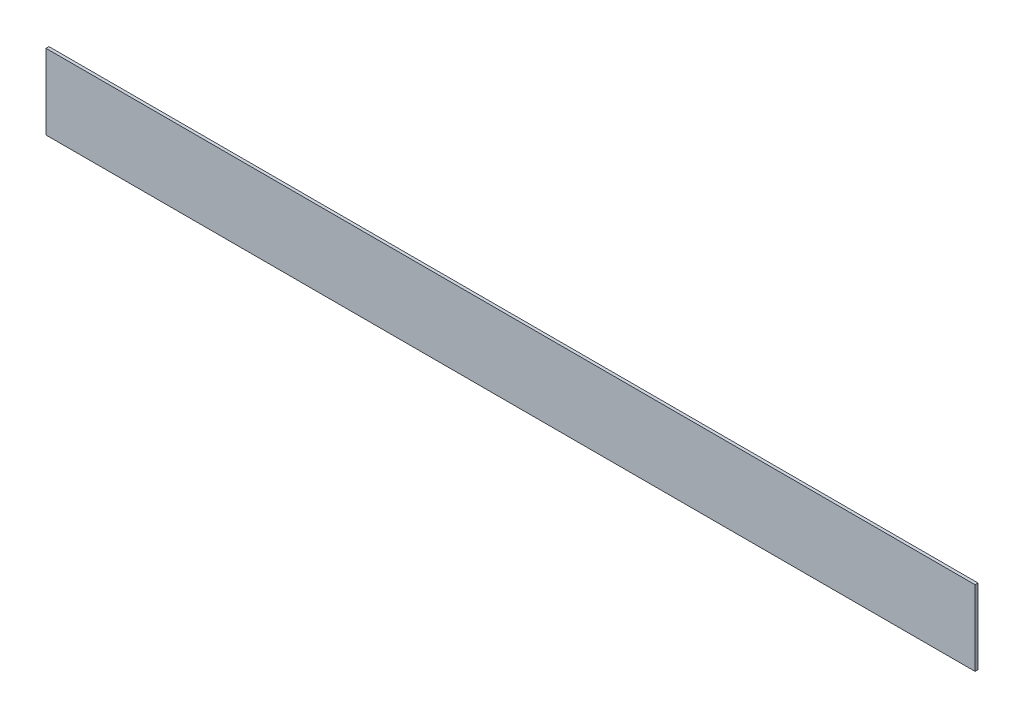
ISO-10303-21;
HEADER;
FILE_DESCRIPTION(('STEP AP214'),'2;1');
FILE_NAME('part.step','',(''),(''),'','','');
FILE_SCHEMA(('AUTOMOTIVE_DESIGN { 1 0 10303 214 1 1 1 1 }'));
ENDSEC;
DATA;
#1=APPLICATION_CONTEXT('core data for automotive mechanical design processes');
#2=APPLICATION_PROTOCOL_DEFINITION('international standard','automotive_design',2000,#1);
#3=PRODUCT_CONTEXT('',#1,'mechanical');
#4=PRODUCT('Part','Part','',(#3));
#5=PRODUCT_RELATED_PRODUCT_CATEGORY('part','',(#4));
#6=PRODUCT_DEFINITION_FORMATION('','',#4);
#7=PRODUCT_DEFINITION_CONTEXT('part definition',#1,'design');
#8=PRODUCT_DEFINITION('design','',#6,#7);
#9=PRODUCT_DEFINITION_SHAPE('','',#8);
#10=(LENGTH_UNIT() NAMED_UNIT(*) SI_UNIT(.MILLI.,.METRE.));
#11=(NAMED_UNIT(*) PLANE_ANGLE_UNIT() SI_UNIT($,.RADIAN.));
#12=(NAMED_UNIT(*) SI_UNIT($,.STERADIAN.) SOLID_ANGLE_UNIT());
#13=UNCERTAINTY_MEASURE_WITH_UNIT(LENGTH_MEASURE(1.E-05),#10,'distance_accuracy_value','');
#14=(GEOMETRIC_REPRESENTATION_CONTEXT(3) GLOBAL_UNCERTAINTY_ASSIGNED_CONTEXT((#13)) GLOBAL_UNIT_ASSIGNED_CONTEXT((#10,
#11,#12)) REPRESENTATION_CONTEXT('',''));
#15=CARTESIAN_POINT('',(0.,0.,0.));
#16=DIRECTION('',(0.,0.,1.));
#17=DIRECTION('',(1.,0.,0.));
#18=AXIS2_PLACEMENT_3D('',#15,#16,#17);
#19=CARTESIAN_POINT('',(0.,0.,9.525));
#20=DIRECTION('',(1.,0.,0.));
#21=DIRECTION('',(0.,0.,-1.));
#22=AXIS2_PLACEMENT_3D('',#19,#20,#21);
#23=PLANE('',#22);
#24=DIRECTION('',(0.,-1.,0.));
#25=VECTOR('',#24,1.);
#26=CARTESIAN_POINT('',(0.,0.,0.));
#27=LINE('',#26,#25);
#28=CARTESIAN_POINT('',(0.,241.3,0.));
#29=VERTEX_POINT('',#28);
#30=CARTESIAN_POINT('',(0.,0.,0.));
#31=VERTEX_POINT('',#30);
#32=EDGE_CURVE('E98',#29,#31,#27,.T.);
#33=ORIENTED_EDGE('',*,*,#32,.T.);
#34=DIRECTION('',(0.,0.,-1.));
#35=VECTOR('',#34,1.);
#36=CARTESIAN_POINT('',(0.,0.,9.525));
#37=LINE('',#36,#35);
#38=CARTESIAN_POINT('',(0.,0.,9.525));
#39=VERTEX_POINT('',#38);
#40=EDGE_CURVE('E11',#39,#31,#37,.T.);
#41=ORIENTED_EDGE('',*,*,#40,.F.);
#42=DIRECTION('',(0.,-1.,0.));
#43=VECTOR('',#42,1.);
#44=CARTESIAN_POINT('',(0.,0.,9.525));
#45=LINE('',#44,#43);
#46=CARTESIAN_POINT('',(0.,241.3,9.525));
#47=VERTEX_POINT('',#46);
#48=EDGE_CURVE('E86',#47,#39,#45,.T.);
#49=ORIENTED_EDGE('',*,*,#48,.F.);
#50=DIRECTION('',(0.,0.,-1.));
#51=VECTOR('',#50,1.);
#52=CARTESIAN_POINT('',(0.,241.3,9.525));
#53=LINE('',#52,#51);
#54=EDGE_CURVE('E94',#47,#29,#53,.T.);
#55=ORIENTED_EDGE('',*,*,#54,.T.);
#56=EDGE_LOOP('',(#33,#41,#49,#55));
#57=FACE_BOUND('',#56,.T.);
#58=ADVANCED_FACE('F35',(#57),#23,.F.);
#59=CARTESIAN_POINT('',(0.,0.,9.525));
#60=DIRECTION('',(0.,1.,0.));
#61=DIRECTION('',(0.,0.,1.));
#62=AXIS2_PLACEMENT_3D('',#59,#60,#61);
#63=PLANE('',#62);
#64=DIRECTION('',(1.,0.,0.));
#65=VECTOR('',#64,1.);
#66=CARTESIAN_POINT('',(0.,0.,0.));
#67=LINE('',#66,#65);
#68=CARTESIAN_POINT('',(2984.5,0.,0.));
#69=VERTEX_POINT('',#68);
#70=EDGE_CURVE('E90',#31,#69,#67,.T.);
#71=ORIENTED_EDGE('',*,*,#70,.T.);
#72=DIRECTION('',(0.,0.,-1.));
#73=VECTOR('',#72,1.);
#74=CARTESIAN_POINT('',(2984.5,0.,9.525));
#75=LINE('',#74,#73);
#76=CARTESIAN_POINT('',(2984.5,0.,9.525));
#77=VERTEX_POINT('',#76);
#78=EDGE_CURVE('E43',#77,#69,#75,.T.);
#79=ORIENTED_EDGE('',*,*,#78,.F.);
#80=DIRECTION('',(1.,0.,0.));
#81=VECTOR('',#80,1.);
#82=CARTESIAN_POINT('',(0.,0.,9.525));
#83=LINE('',#82,#81);
#84=EDGE_CURVE('E81',#39,#77,#83,.T.);
#85=ORIENTED_EDGE('',*,*,#84,.F.);
#86=ORIENTED_EDGE('',*,*,#40,.T.);
#87=EDGE_LOOP('',(#71,#79,#85,#86));
#88=FACE_BOUND('',#87,.T.);
#89=ADVANCED_FACE('F89',(#88),#63,.F.);
#90=CARTESIAN_POINT('',(2984.5,241.3,9.525));
#91=DIRECTION('',(-1.,0.,0.));
#92=DIRECTION('',(0.,0.,1.));
#93=AXIS2_PLACEMENT_3D('',#90,#91,#92);
#94=PLANE('',#93);
#95=DIRECTION('',(0.,1.,0.));
#96=VECTOR('',#95,1.);
#97=CARTESIAN_POINT('',(2984.5,241.3,0.));
#98=LINE('',#97,#96);
#99=CARTESIAN_POINT('',(2984.5,241.3,0.));
#100=VERTEX_POINT('',#99);
#101=EDGE_CURVE('E68',#69,#100,#98,.T.);
#102=ORIENTED_EDGE('',*,*,#101,.T.);
#103=DIRECTION('',(0.,0.,-1.));
#104=VECTOR('',#103,1.);
#105=CARTESIAN_POINT('',(2984.5,241.3,9.525));
#106=LINE('',#105,#104);
#107=CARTESIAN_POINT('',(2984.5,241.3,9.525));
#108=VERTEX_POINT('',#107);
#109=EDGE_CURVE('E91',#108,#100,#106,.T.);
#110=ORIENTED_EDGE('',*,*,#109,.F.);
#111=DIRECTION('',(0.,1.,0.));
#112=VECTOR('',#111,1.);
#113=CARTESIAN_POINT('',(2984.5,241.3,9.525));
#114=LINE('',#113,#112);
#115=EDGE_CURVE('E84',#77,#108,#114,.T.);
#116=ORIENTED_EDGE('',*,*,#115,.F.);
#117=ORIENTED_EDGE('',*,*,#78,.T.);
#118=EDGE_LOOP('',(#102,#110,#116,#117));
#119=FACE_BOUND('',#118,.T.);
#120=ADVANCED_FACE('F92',(#119),#94,.F.);
#121=CARTESIAN_POINT('',(0.,241.3,9.525));
#122=DIRECTION('',(0.,-1.,0.));
#123=DIRECTION('',(1.,0.,0.));
#124=AXIS2_PLACEMENT_3D('',#121,#122,#123);
#125=PLANE('',#124);
#126=DIRECTION('',(-1.,0.,0.));
#127=VECTOR('',#126,1.);
#128=CARTESIAN_POINT('',(0.,241.3,0.));
#129=LINE('',#128,#127);
#130=EDGE_CURVE('E74',#100,#29,#129,.T.);
#131=ORIENTED_EDGE('',*,*,#130,.T.);
#132=ORIENTED_EDGE('',*,*,#54,.F.);
#133=DIRECTION('',(-1.,0.,0.));
#134=VECTOR('',#133,1.);
#135=CARTESIAN_POINT('',(0.,241.3,9.525));
#136=LINE('',#135,#134);
#137=EDGE_CURVE('E51',#108,#47,#136,.T.);
#138=ORIENTED_EDGE('',*,*,#137,.F.);
#139=ORIENTED_EDGE('',*,*,#109,.T.);
#140=EDGE_LOOP('',(#131,#132,#138,#139));
#141=FACE_BOUND('',#140,.T.);
#142=ADVANCED_FACE('F105',(#141),#125,.F.);
#143=CARTESIAN_POINT('',(0.,0.,9.525));
#144=DIRECTION('',(0.,0.,-1.));
#145=DIRECTION('',(-1.,0.,0.));
#146=AXIS2_PLACEMENT_3D('',#143,#144,#145);
#147=PLANE('',#146);
#148=ORIENTED_EDGE('',*,*,#48,.T.);
#149=ORIENTED_EDGE('',*,*,#84,.T.);
#150=ORIENTED_EDGE('',*,*,#115,.T.);
#151=ORIENTED_EDGE('',*,*,#137,.T.);
#152=EDGE_LOOP('',(#148,#149,#150,#151));
#153=FACE_BOUND('',#152,.T.);
#154=ADVANCED_FACE('F82',(#153),#147,.F.);
#155=CARTESIAN_POINT('',(0.,0.,0.));
#156=DIRECTION('',(0.,0.,-1.));
#157=DIRECTION('',(-1.,0.,0.));
#158=AXIS2_PLACEMENT_3D('',#155,#156,#157);
#159=PLANE('',#158);
#160=ORIENTED_EDGE('',*,*,#32,.F.);
#161=ORIENTED_EDGE('',*,*,#130,.F.);
#162=ORIENTED_EDGE('',*,*,#101,.F.);
#163=ORIENTED_EDGE('',*,*,#70,.F.);
#164=EDGE_LOOP('',(#160,#161,#162,#163));
#165=FACE_BOUND('',#164,.T.);
#166=ADVANCED_FACE('F108',(#165),#159,.T.);
#167=CLOSED_SHELL('',(#58,#89,#120,#142,#154,#166));
#168=MANIFOLD_SOLID_BREP('B2',#167);
#169=ADVANCED_BREP_SHAPE_REPRESENTATION('',(#18,#168),#14);
#170=SHAPE_DEFINITION_REPRESENTATION(#9,#169);
ENDSEC;
END-ISO-10303-21;
